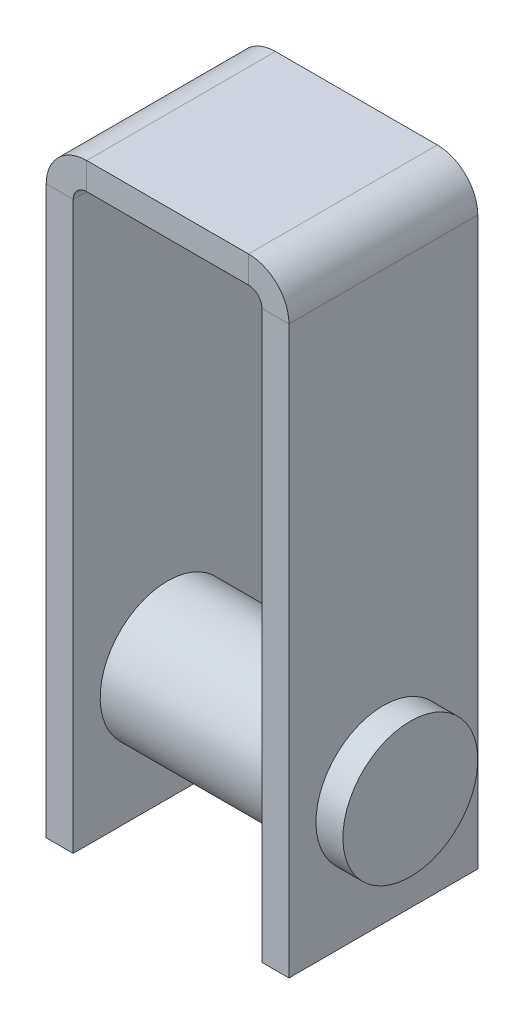
ISO-10303-21;
HEADER;
FILE_DESCRIPTION(('STEP AP214'),'2;1');
FILE_NAME('part.step','',(''),(''),'','','');
FILE_SCHEMA(('AUTOMOTIVE_DESIGN { 1 0 10303 214 1 1 1 1 }'));
ENDSEC;
DATA;
#1=APPLICATION_CONTEXT('core data for automotive mechanical design processes');
#2=APPLICATION_PROTOCOL_DEFINITION('international standard','automotive_design',2000,#1);
#3=PRODUCT_CONTEXT('',#1,'mechanical');
#4=PRODUCT('Part','Part','',(#3));
#5=PRODUCT_RELATED_PRODUCT_CATEGORY('part','',(#4));
#6=PRODUCT_DEFINITION_FORMATION('','',#4);
#7=PRODUCT_DEFINITION_CONTEXT('part definition',#1,'design');
#8=PRODUCT_DEFINITION('design','',#6,#7);
#9=PRODUCT_DEFINITION_SHAPE('','',#8);
#10=(LENGTH_UNIT() NAMED_UNIT(*) SI_UNIT(.MILLI.,.METRE.));
#11=(NAMED_UNIT(*) PLANE_ANGLE_UNIT() SI_UNIT($,.RADIAN.));
#12=(NAMED_UNIT(*) SI_UNIT($,.STERADIAN.) SOLID_ANGLE_UNIT());
#13=UNCERTAINTY_MEASURE_WITH_UNIT(LENGTH_MEASURE(1.E-05),#10,'distance_accuracy_value','');
#14=(GEOMETRIC_REPRESENTATION_CONTEXT(3) GLOBAL_UNCERTAINTY_ASSIGNED_CONTEXT((#13)) GLOBAL_UNIT_ASSIGNED_CONTEXT((#10,
#11,#12)) REPRESENTATION_CONTEXT('',''));
#15=CARTESIAN_POINT('',(0.,0.,0.));
#16=DIRECTION('',(0.,0.,1.));
#17=DIRECTION('',(1.,0.,0.));
#18=AXIS2_PLACEMENT_3D('',#15,#16,#17);
#19=CARTESIAN_POINT('',(-31.6451788984849,-220.,0.));
#20=DIRECTION('',(0.,-1.,0.));
#21=DIRECTION('',(0.,0.,1.));
#22=AXIS2_PLACEMENT_3D('',#19,#20,#21);
#23=PLANE('',#22);
#24=DIRECTION('',(-1.,0.,0.));
#25=VECTOR('',#24,1.);
#26=CARTESIAN_POINT('',(-26.6451788984849,-220.,-35.));
#27=LINE('',#26,#25);
#28=CARTESIAN_POINT('',(-26.6451788984849,-220.,-35.));
#29=VERTEX_POINT('',#28);
#30=CARTESIAN_POINT('',(-36.6451788984849,-220.,-35.));
#31=VERTEX_POINT('',#30);
#32=EDGE_CURVE('E143',#29,#31,#27,.T.);
#33=ORIENTED_EDGE('',*,*,#32,.F.);
#34=DIRECTION('',(0.,0.,-1.));
#35=VECTOR('',#34,1.);
#36=CARTESIAN_POINT('',(-26.6451788984849,-220.,35.));
#37=LINE('',#36,#35);
#38=CARTESIAN_POINT('',(-26.6451788984849,-220.,35.));
#39=VERTEX_POINT('',#38);
#40=EDGE_CURVE('E145',#39,#29,#37,.T.);
#41=ORIENTED_EDGE('',*,*,#40,.F.);
#42=DIRECTION('',(1.,0.,0.));
#43=VECTOR('',#42,1.);
#44=CARTESIAN_POINT('',(-26.6451788984849,-220.,35.));
#45=LINE('',#44,#43);
#46=CARTESIAN_POINT('',(-36.6451788984849,-220.,35.));
#47=VERTEX_POINT('',#46);
#48=EDGE_CURVE('E163',#47,#39,#45,.T.);
#49=ORIENTED_EDGE('',*,*,#48,.F.);
#50=DIRECTION('',(0.,0.,1.));
#51=VECTOR('',#50,1.);
#52=CARTESIAN_POINT('',(-36.6451788984849,-220.,35.));
#53=LINE('',#52,#51);
#54=EDGE_CURVE('E148',#31,#47,#53,.T.);
#55=ORIENTED_EDGE('',*,*,#54,.F.);
#56=EDGE_LOOP('',(#33,#41,#49,#55));
#57=FACE_BOUND('',#56,.T.);
#58=ADVANCED_FACE('F34',(#57),#23,.T.);
#59=CARTESIAN_POINT('',(48.3548211015151,-220.,0.));
#60=DIRECTION('',(0.,1.,0.));
#61=DIRECTION('',(0.,0.,1.));
#62=AXIS2_PLACEMENT_3D('',#59,#60,#61);
#63=PLANE('',#62);
#64=DIRECTION('',(1.,0.,0.));
#65=VECTOR('',#64,1.);
#66=CARTESIAN_POINT('',(43.3548211015151,-220.,-35.));
#67=LINE('',#66,#65);
#68=CARTESIAN_POINT('',(43.3548211015151,-220.,-35.));
#69=VERTEX_POINT('',#68);
#70=CARTESIAN_POINT('',(53.3548211015151,-220.,-35.));
#71=VERTEX_POINT('',#70);
#72=EDGE_CURVE('E204',#69,#71,#67,.T.);
#73=ORIENTED_EDGE('',*,*,#72,.T.);
#74=DIRECTION('',(0.,0.,1.));
#75=VECTOR('',#74,1.);
#76=CARTESIAN_POINT('',(53.3548211015151,-220.,35.));
#77=LINE('',#76,#75);
#78=CARTESIAN_POINT('',(53.3548211015151,-220.,35.));
#79=VERTEX_POINT('',#78);
#80=EDGE_CURVE('E54',#71,#79,#77,.T.);
#81=ORIENTED_EDGE('',*,*,#80,.T.);
#82=DIRECTION('',(-1.,0.,0.));
#83=VECTOR('',#82,1.);
#84=CARTESIAN_POINT('',(43.3548211015151,-220.,35.));
#85=LINE('',#84,#83);
#86=CARTESIAN_POINT('',(43.3548211015151,-220.,35.));
#87=VERTEX_POINT('',#86);
#88=EDGE_CURVE('E48',#79,#87,#85,.T.);
#89=ORIENTED_EDGE('',*,*,#88,.T.);
#90=DIRECTION('',(0.,0.,-1.));
#91=VECTOR('',#90,1.);
#92=CARTESIAN_POINT('',(43.3548211015151,-220.,35.));
#93=LINE('',#92,#91);
#94=EDGE_CURVE('E11',#87,#69,#93,.T.);
#95=ORIENTED_EDGE('',*,*,#94,.T.);
#96=EDGE_LOOP('',(#73,#81,#89,#95));
#97=FACE_BOUND('',#96,.T.);
#98=ADVANCED_FACE('F295',(#97),#63,.F.);
#99=CARTESIAN_POINT('',(-26.6451788984849,-220.,-35.));
#100=DIRECTION('',(0.,0.,-1.));
#101=DIRECTION('',(-1.,0.,0.));
#102=AXIS2_PLACEMENT_3D('',#99,#100,#101);
#103=PLANE('',#102);
#104=DIRECTION('',(0.,1.,0.));
#105=VECTOR('',#104,1.);
#106=CARTESIAN_POINT('',(-36.6451788984849,-220.,-35.));
#107=LINE('',#106,#105);
#108=CARTESIAN_POINT('',(-36.6451788984849,-10.0000000000001,-35.));
#109=VERTEX_POINT('',#108);
#110=EDGE_CURVE('E170',#31,#109,#107,.T.);
#111=ORIENTED_EDGE('',*,*,#110,.T.);
#112=DIRECTION('',(-1.,0.,0.));
#113=VECTOR('',#112,1.);
#114=CARTESIAN_POINT('',(-26.6451788984849,-10.0000000000001,-35.));
#115=LINE('',#114,#113);
#116=CARTESIAN_POINT('',(-26.6451788984849,-10.0000000000001,-35.));
#117=VERTEX_POINT('',#116);
#118=EDGE_CURVE('E168',#117,#109,#115,.T.);
#119=ORIENTED_EDGE('',*,*,#118,.F.);
#120=DIRECTION('',(0.,1.,0.));
#121=VECTOR('',#120,1.);
#122=CARTESIAN_POINT('',(-26.6451788984849,-220.,-35.));
#123=LINE('',#122,#121);
#124=EDGE_CURVE('E160',#29,#117,#123,.T.);
#125=ORIENTED_EDGE('',*,*,#124,.F.);
#126=ORIENTED_EDGE('',*,*,#32,.T.);
#127=EDGE_LOOP('',(#111,#119,#125,#126));
#128=FACE_BOUND('',#127,.T.);
#129=ADVANCED_FACE('F166',(#128),#103,.T.);
#130=CARTESIAN_POINT('',(-36.6451788984849,-220.,35.));
#131=DIRECTION('',(-1.,0.,0.));
#132=DIRECTION('',(0.,-1.,0.));
#133=AXIS2_PLACEMENT_3D('',#130,#131,#132);
#134=PLANE('',#133);
#135=CARTESIAN_POINT('',(-36.6451788984849,-175.,0.));
#136=DIRECTION('',(-1.,0.,0.));
#137=DIRECTION('',(0.,-1.,0.));
#138=AXIS2_PLACEMENT_3D('',#135,#136,#137);
#139=CIRCLE('',#138,25.);
#140=CARTESIAN_POINT('',(-36.6451788984849,-200.,0.));
#141=VERTEX_POINT('',#140);
#142=EDGE_CURVE('E534',#141,#141,#139,.T.);
#143=ORIENTED_EDGE('',*,*,#142,.F.);
#144=EDGE_LOOP('',(#143));
#145=FACE_BOUND('',#144,.T.);
#146=DIRECTION('',(0.,1.,0.));
#147=VECTOR('',#146,1.);
#148=CARTESIAN_POINT('',(-36.6451788984849,-220.,35.));
#149=LINE('',#148,#147);
#150=CARTESIAN_POINT('',(-36.6451788984849,-10.0000000000001,35.));
#151=VERTEX_POINT('',#150);
#152=EDGE_CURVE('E215',#47,#151,#149,.T.);
#153=ORIENTED_EDGE('',*,*,#152,.T.);
#154=DIRECTION('',(0.,0.,1.));
#155=VECTOR('',#154,1.);
#156=CARTESIAN_POINT('',(-36.6451788984849,-10.0000000000001,35.));
#157=LINE('',#156,#155);
#158=EDGE_CURVE('E212',#109,#151,#157,.T.);
#159=ORIENTED_EDGE('',*,*,#158,.F.);
#160=ORIENTED_EDGE('',*,*,#110,.F.);
#161=ORIENTED_EDGE('',*,*,#54,.T.);
#162=EDGE_LOOP('',(#153,#159,#160,#161));
#163=FACE_BOUND('',#162,.T.);
#164=ADVANCED_FACE('F333',(#145,#163),#134,.T.);
#165=CARTESIAN_POINT('',(-26.6451788984849,-220.,35.));
#166=DIRECTION('',(0.,0.,1.));
#167=DIRECTION('',(1.,0.,0.));
#168=AXIS2_PLACEMENT_3D('',#165,#166,#167);
#169=PLANE('',#168);
#170=DIRECTION('',(0.,1.,0.));
#171=VECTOR('',#170,1.);
#172=CARTESIAN_POINT('',(-26.6451788984849,-220.,35.));
#173=LINE('',#172,#171);
#174=CARTESIAN_POINT('',(-26.6451788984849,-10.0000000000001,35.));
#175=VERTEX_POINT('',#174);
#176=EDGE_CURVE('E162',#39,#175,#173,.T.);
#177=ORIENTED_EDGE('',*,*,#176,.T.);
#178=DIRECTION('',(1.,0.,0.));
#179=VECTOR('',#178,1.);
#180=CARTESIAN_POINT('',(-26.6451788984849,-10.0000000000001,35.));
#181=LINE('',#180,#179);
#182=EDGE_CURVE('E218',#151,#175,#181,.T.);
#183=ORIENTED_EDGE('',*,*,#182,.F.);
#184=ORIENTED_EDGE('',*,*,#152,.F.);
#185=ORIENTED_EDGE('',*,*,#48,.T.);
#186=EDGE_LOOP('',(#177,#183,#184,#185));
#187=FACE_BOUND('',#186,.T.);
#188=ADVANCED_FACE('F280',(#187),#169,.T.);
#189=CARTESIAN_POINT('',(-26.6451788984849,-220.,35.));
#190=DIRECTION('',(1.,0.,0.));
#191=DIRECTION('',(0.,1.,0.));
#192=AXIS2_PLACEMENT_3D('',#189,#190,#191);
#193=PLANE('',#192);
#194=CARTESIAN_POINT('',(-26.6451788984849,-175.,0.));
#195=DIRECTION('',(1.,0.,0.));
#196=DIRECTION('',(0.,1.,0.));
#197=AXIS2_PLACEMENT_3D('',#194,#195,#196);
#198=CIRCLE('',#197,25.);
#199=CARTESIAN_POINT('',(-26.6451788984849,-150.,0.));
#200=VERTEX_POINT('',#199);
#201=EDGE_CURVE('E153',#200,#200,#198,.T.);
#202=ORIENTED_EDGE('',*,*,#201,.F.);
#203=EDGE_LOOP('',(#202));
#204=FACE_BOUND('',#203,.T.);
#205=DIRECTION('',(0.,0.,-1.));
#206=VECTOR('',#205,1.);
#207=CARTESIAN_POINT('',(-26.6451788984849,-10.0000000000001,35.));
#208=LINE('',#207,#206);
#209=EDGE_CURVE('E183',#175,#117,#208,.T.);
#210=ORIENTED_EDGE('',*,*,#209,.F.);
#211=ORIENTED_EDGE('',*,*,#176,.F.);
#212=ORIENTED_EDGE('',*,*,#40,.T.);
#213=ORIENTED_EDGE('',*,*,#124,.T.);
#214=EDGE_LOOP('',(#210,#211,#212,#213));
#215=FACE_BOUND('',#214,.T.);
#216=ADVANCED_FACE('F159',(#204,#215),#193,.T.);
#217=CARTESIAN_POINT('',(-26.6451788984849,-10.,-35.));
#218=DIRECTION('',(0.,0.,-1.));
#219=DIRECTION('',(-1.,0.,0.));
#220=AXIS2_PLACEMENT_3D('',#217,#218,#219);
#221=PLANE('',#220);
#222=CARTESIAN_POINT('',(-21.6451788984849,-10.,-35.));
#223=DIRECTION('',(0.,0.,-1.));
#224=DIRECTION('',(-1.,0.,0.));
#225=AXIS2_PLACEMENT_3D('',#222,#223,#224);
#226=CIRCLE('',#225,15.);
#227=CARTESIAN_POINT('',(-21.6451788984848,5.00000000000001,-35.));
#228=VERTEX_POINT('',#227);
#229=EDGE_CURVE('E176',#109,#228,#226,.T.);
#230=ORIENTED_EDGE('',*,*,#229,.T.);
#231=DIRECTION('',(0.,1.,0.));
#232=VECTOR('',#231,1.);
#233=CARTESIAN_POINT('',(-21.6451788984848,-5.,-35.));
#234=LINE('',#233,#232);
#235=CARTESIAN_POINT('',(-21.6451788984848,-4.99999999999999,-35.));
#236=VERTEX_POINT('',#235);
#237=EDGE_CURVE('E174',#236,#228,#234,.T.);
#238=ORIENTED_EDGE('',*,*,#237,.F.);
#239=CARTESIAN_POINT('',(-21.6451788984849,-10.,-35.));
#240=DIRECTION('',(0.,0.,-1.));
#241=DIRECTION('',(-1.,0.,0.));
#242=AXIS2_PLACEMENT_3D('',#239,#240,#241);
#243=CIRCLE('',#242,5.);
#244=EDGE_CURVE('E177',#117,#236,#243,.T.);
#245=ORIENTED_EDGE('',*,*,#244,.F.);
#246=ORIENTED_EDGE('',*,*,#118,.T.);
#247=EDGE_LOOP('',(#230,#238,#245,#246));
#248=FACE_BOUND('',#247,.T.);
#249=ADVANCED_FACE('F276',(#248),#221,.T.);
#250=CARTESIAN_POINT('',(-21.6451788984849,-10.,0.));
#251=DIRECTION('',(0.,0.,-1.));
#252=DIRECTION('',(-1.,0.,0.));
#253=AXIS2_PLACEMENT_3D('',#250,#251,#252);
#254=CYLINDRICAL_SURFACE('',#253,15.);
#255=CARTESIAN_POINT('',(-21.6451788984849,-10.,35.));
#256=DIRECTION('',(0.,0.,-1.));
#257=DIRECTION('',(-1.,0.,0.));
#258=AXIS2_PLACEMENT_3D('',#255,#256,#257);
#259=CIRCLE('',#258,15.);
#260=CARTESIAN_POINT('',(-21.6451788984848,5.00000000000001,35.));
#261=VERTEX_POINT('',#260);
#262=EDGE_CURVE('E220',#151,#261,#259,.T.);
#263=ORIENTED_EDGE('',*,*,#262,.T.);
#264=DIRECTION('',(0.,0.,1.));
#265=VECTOR('',#264,1.);
#266=CARTESIAN_POINT('',(-21.6451788984848,5.,35.));
#267=LINE('',#266,#265);
#268=EDGE_CURVE('E180',#228,#261,#267,.T.);
#269=ORIENTED_EDGE('',*,*,#268,.F.);
#270=ORIENTED_EDGE('',*,*,#229,.F.);
#271=ORIENTED_EDGE('',*,*,#158,.T.);
#272=EDGE_LOOP('',(#263,#269,#270,#271));
#273=FACE_BOUND('',#272,.T.);
#274=ADVANCED_FACE('F287',(#273),#254,.T.);
#275=CARTESIAN_POINT('',(-26.6451788984849,-10.,35.));
#276=DIRECTION('',(0.,0.,1.));
#277=DIRECTION('',(1.,0.,0.));
#278=AXIS2_PLACEMENT_3D('',#275,#276,#277);
#279=PLANE('',#278);
#280=CARTESIAN_POINT('',(-21.6451788984849,-10.,35.));
#281=DIRECTION('',(0.,0.,-1.));
#282=DIRECTION('',(-1.,0.,0.));
#283=AXIS2_PLACEMENT_3D('',#280,#281,#282);
#284=CIRCLE('',#283,5.);
#285=CARTESIAN_POINT('',(-21.6451788984848,-4.99999999999999,35.));
#286=VERTEX_POINT('',#285);
#287=EDGE_CURVE('E241',#175,#286,#284,.T.);
#288=ORIENTED_EDGE('',*,*,#287,.T.);
#289=DIRECTION('',(0.,-1.,0.));
#290=VECTOR('',#289,1.);
#291=CARTESIAN_POINT('',(-21.6451788984848,-5.,35.));
#292=LINE('',#291,#290);
#293=EDGE_CURVE('E223',#261,#286,#292,.T.);
#294=ORIENTED_EDGE('',*,*,#293,.F.);
#295=ORIENTED_EDGE('',*,*,#262,.F.);
#296=ORIENTED_EDGE('',*,*,#182,.T.);
#297=EDGE_LOOP('',(#288,#294,#295,#296));
#298=FACE_BOUND('',#297,.T.);
#299=ADVANCED_FACE('F283',(#298),#279,.T.);
#300=CARTESIAN_POINT('',(-21.6451788984849,-10.,0.));
#301=DIRECTION('',(0.,0.,-1.));
#302=DIRECTION('',(-1.,0.,0.));
#303=AXIS2_PLACEMENT_3D('',#300,#301,#302);
#304=CYLINDRICAL_SURFACE('',#303,5.);
#305=DIRECTION('',(0.,0.,-1.));
#306=VECTOR('',#305,1.);
#307=CARTESIAN_POINT('',(-21.6451788984848,-5.,35.));
#308=LINE('',#307,#306);
#309=EDGE_CURVE('E192',#286,#236,#308,.T.);
#310=ORIENTED_EDGE('',*,*,#309,.F.);
#311=ORIENTED_EDGE('',*,*,#287,.F.);
#312=ORIENTED_EDGE('',*,*,#209,.T.);
#313=ORIENTED_EDGE('',*,*,#244,.T.);
#314=EDGE_LOOP('',(#310,#311,#312,#313));
#315=FACE_BOUND('',#314,.T.);
#316=ADVANCED_FACE('F277',(#315),#304,.F.);
#317=CARTESIAN_POINT('',(-21.6451788984848,-5.,-35.));
#318=DIRECTION('',(0.,0.,-1.));
#319=DIRECTION('',(-1.,0.,0.));
#320=AXIS2_PLACEMENT_3D('',#317,#318,#319);
#321=PLANE('',#320);
#322=DIRECTION('',(1.,0.,0.));
#323=VECTOR('',#322,1.);
#324=CARTESIAN_POINT('',(-21.6451788984848,5.,-35.));
#325=LINE('',#324,#323);
#326=CARTESIAN_POINT('',(38.354821101515,5.,-35.));
#327=VERTEX_POINT('',#326);
#328=EDGE_CURVE('E125',#228,#327,#325,.T.);
#329=ORIENTED_EDGE('',*,*,#328,.T.);
#330=DIRECTION('',(0.,1.,0.));
#331=VECTOR('',#330,1.);
#332=CARTESIAN_POINT('',(38.354821101515,-5.,-35.));
#333=LINE('',#332,#331);
#334=CARTESIAN_POINT('',(38.354821101515,-5.,-35.));
#335=VERTEX_POINT('',#334);
#336=EDGE_CURVE('E184',#335,#327,#333,.T.);
#337=ORIENTED_EDGE('',*,*,#336,.F.);
#338=DIRECTION('',(1.,0.,0.));
#339=VECTOR('',#338,1.);
#340=CARTESIAN_POINT('',(-21.6451788984848,-5.,-35.));
#341=LINE('',#340,#339);
#342=EDGE_CURVE('E190',#236,#335,#341,.T.);
#343=ORIENTED_EDGE('',*,*,#342,.F.);
#344=ORIENTED_EDGE('',*,*,#237,.T.);
#345=EDGE_LOOP('',(#329,#337,#343,#344));
#346=FACE_BOUND('',#345,.T.);
#347=ADVANCED_FACE('F270',(#346),#321,.T.);
#348=CARTESIAN_POINT('',(-21.6451788984848,5.,35.));
#349=DIRECTION('',(0.,1.,0.));
#350=DIRECTION('',(0.,0.,1.));
#351=AXIS2_PLACEMENT_3D('',#348,#349,#350);
#352=PLANE('',#351);
#353=DIRECTION('',(1.,0.,0.));
#354=VECTOR('',#353,1.);
#355=CARTESIAN_POINT('',(-21.6451788984848,5.,35.));
#356=LINE('',#355,#354);
#357=CARTESIAN_POINT('',(38.354821101515,5.,35.));
#358=VERTEX_POINT('',#357);
#359=EDGE_CURVE('E118',#261,#358,#356,.T.);
#360=ORIENTED_EDGE('',*,*,#359,.T.);
#361=DIRECTION('',(0.,0.,1.));
#362=VECTOR('',#361,1.);
#363=CARTESIAN_POINT('',(38.354821101515,5.,35.));
#364=LINE('',#363,#362);
#365=EDGE_CURVE('E187',#327,#358,#364,.T.);
#366=ORIENTED_EDGE('',*,*,#365,.F.);
#367=ORIENTED_EDGE('',*,*,#328,.F.);
#368=ORIENTED_EDGE('',*,*,#268,.T.);
#369=EDGE_LOOP('',(#360,#366,#367,#368));
#370=FACE_BOUND('',#369,.T.);
#371=ADVANCED_FACE('F289',(#370),#352,.T.);
#372=CARTESIAN_POINT('',(-21.6451788984848,-5.,35.));
#373=DIRECTION('',(0.,0.,1.));
#374=DIRECTION('',(1.,0.,0.));
#375=AXIS2_PLACEMENT_3D('',#372,#373,#374);
#376=PLANE('',#375);
#377=DIRECTION('',(1.,0.,0.));
#378=VECTOR('',#377,1.);
#379=CARTESIAN_POINT('',(-21.6451788984848,-5.,35.));
#380=LINE('',#379,#378);
#381=CARTESIAN_POINT('',(38.354821101515,-5.,35.));
#382=VERTEX_POINT('',#381);
#383=EDGE_CURVE('E188',#286,#382,#380,.T.);
#384=ORIENTED_EDGE('',*,*,#383,.T.);
#385=DIRECTION('',(0.,-1.,0.));
#386=VECTOR('',#385,1.);
#387=CARTESIAN_POINT('',(38.354821101515,-5.,35.));
#388=LINE('',#387,#386);
#389=EDGE_CURVE('E226',#358,#382,#388,.T.);
#390=ORIENTED_EDGE('',*,*,#389,.F.);
#391=ORIENTED_EDGE('',*,*,#359,.F.);
#392=ORIENTED_EDGE('',*,*,#293,.T.);
#393=EDGE_LOOP('',(#384,#390,#391,#392));
#394=FACE_BOUND('',#393,.T.);
#395=ADVANCED_FACE('F301',(#394),#376,.T.);
#396=CARTESIAN_POINT('',(-21.6451788984848,-5.,35.));
#397=DIRECTION('',(0.,-1.,0.));
#398=DIRECTION('',(0.,0.,-1.));
#399=AXIS2_PLACEMENT_3D('',#396,#397,#398);
#400=PLANE('',#399);
#401=DIRECTION('',(0.,0.,-1.));
#402=VECTOR('',#401,1.);
#403=CARTESIAN_POINT('',(38.354821101515,-5.,35.));
#404=LINE('',#403,#402);
#405=EDGE_CURVE('E203',#382,#335,#404,.T.);
#406=ORIENTED_EDGE('',*,*,#405,.F.);
#407=ORIENTED_EDGE('',*,*,#383,.F.);
#408=ORIENTED_EDGE('',*,*,#309,.T.);
#409=ORIENTED_EDGE('',*,*,#342,.T.);
#410=EDGE_LOOP('',(#406,#407,#408,#409));
#411=FACE_BOUND('',#410,.T.);
#412=ADVANCED_FACE('F273',(#411),#400,.T.);
#413=CARTESIAN_POINT('',(38.354821101515,-5.,-35.));
#414=DIRECTION('',(0.,0.,-1.));
#415=DIRECTION('',(-1.,0.,0.));
#416=AXIS2_PLACEMENT_3D('',#413,#414,#415);
#417=PLANE('',#416);
#418=CARTESIAN_POINT('',(38.3548211015151,-10.,-35.));
#419=DIRECTION('',(0.,0.,-1.));
#420=DIRECTION('',(0.,1.,0.));
#421=AXIS2_PLACEMENT_3D('',#418,#419,#420);
#422=CIRCLE('',#421,15.);
#423=CARTESIAN_POINT('',(53.3548211015151,-10.,-35.));
#424=VERTEX_POINT('',#423);
#425=EDGE_CURVE('E196',#327,#424,#422,.T.);
#426=ORIENTED_EDGE('',*,*,#425,.T.);
#427=DIRECTION('',(1.,0.,0.));
#428=VECTOR('',#427,1.);
#429=CARTESIAN_POINT('',(43.3548211015151,-10.,-35.));
#430=LINE('',#429,#428);
#431=CARTESIAN_POINT('',(43.3548211015151,-10.,-35.));
#432=VERTEX_POINT('',#431);
#433=EDGE_CURVE('E193',#432,#424,#430,.T.);
#434=ORIENTED_EDGE('',*,*,#433,.F.);
#435=CARTESIAN_POINT('',(38.3548211015151,-10.,-35.));
#436=DIRECTION('',(0.,0.,-1.));
#437=DIRECTION('',(0.,1.,0.));
#438=AXIS2_PLACEMENT_3D('',#435,#436,#437);
#439=CIRCLE('',#438,5.);
#440=EDGE_CURVE('E197',#335,#432,#439,.T.);
#441=ORIENTED_EDGE('',*,*,#440,.F.);
#442=ORIENTED_EDGE('',*,*,#336,.T.);
#443=EDGE_LOOP('',(#426,#434,#441,#442));
#444=FACE_BOUND('',#443,.T.);
#445=ADVANCED_FACE('F265',(#444),#417,.T.);
#446=CARTESIAN_POINT('',(38.3548211015151,-10.,0.));
#447=DIRECTION('',(0.,0.,-1.));
#448=DIRECTION('',(-1.,0.,0.));
#449=AXIS2_PLACEMENT_3D('',#446,#447,#448);
#450=CYLINDRICAL_SURFACE('',#449,15.);
#451=CARTESIAN_POINT('',(38.3548211015151,-10.,35.));
#452=DIRECTION('',(0.,0.,-1.));
#453=DIRECTION('',(0.,1.,0.));
#454=AXIS2_PLACEMENT_3D('',#451,#452,#453);
#455=CIRCLE('',#454,15.);
#456=CARTESIAN_POINT('',(53.3548211015151,-10.,35.));
#457=VERTEX_POINT('',#456);
#458=EDGE_CURVE('E229',#358,#457,#455,.T.);
#459=ORIENTED_EDGE('',*,*,#458,.T.);
#460=DIRECTION('',(0.,0.,1.));
#461=VECTOR('',#460,1.);
#462=CARTESIAN_POINT('',(53.3548211015151,-10.,35.));
#463=LINE('',#462,#461);
#464=EDGE_CURVE('E200',#424,#457,#463,.T.);
#465=ORIENTED_EDGE('',*,*,#464,.F.);
#466=ORIENTED_EDGE('',*,*,#425,.F.);
#467=ORIENTED_EDGE('',*,*,#365,.T.);
#468=EDGE_LOOP('',(#459,#465,#466,#467));
#469=FACE_BOUND('',#468,.T.);
#470=ADVANCED_FACE('F291',(#469),#450,.T.);
#471=CARTESIAN_POINT('',(38.354821101515,-5.,35.));
#472=DIRECTION('',(0.,0.,1.));
#473=DIRECTION('',(1.,0.,0.));
#474=AXIS2_PLACEMENT_3D('',#471,#472,#473);
#475=PLANE('',#474);
#476=CARTESIAN_POINT('',(38.3548211015151,-10.,35.));
#477=DIRECTION('',(0.,0.,-1.));
#478=DIRECTION('',(0.,1.,0.));
#479=AXIS2_PLACEMENT_3D('',#476,#477,#478);
#480=CIRCLE('',#479,5.);
#481=CARTESIAN_POINT('',(43.3548211015151,-10.,35.));
#482=VERTEX_POINT('',#481);
#483=EDGE_CURVE('E248',#382,#482,#480,.T.);
#484=ORIENTED_EDGE('',*,*,#483,.T.);
#485=DIRECTION('',(-1.,0.,0.));
#486=VECTOR('',#485,1.);
#487=CARTESIAN_POINT('',(43.3548211015151,-10.,35.));
#488=LINE('',#487,#486);
#489=EDGE_CURVE('E232',#457,#482,#488,.T.);
#490=ORIENTED_EDGE('',*,*,#489,.F.);
#491=ORIENTED_EDGE('',*,*,#458,.F.);
#492=ORIENTED_EDGE('',*,*,#389,.T.);
#493=EDGE_LOOP('',(#484,#490,#491,#492));
#494=FACE_BOUND('',#493,.T.);
#495=ADVANCED_FACE('F298',(#494),#475,.T.);
#496=CARTESIAN_POINT('',(38.3548211015151,-10.,0.));
#497=DIRECTION('',(0.,0.,-1.));
#498=DIRECTION('',(-1.,0.,0.));
#499=AXIS2_PLACEMENT_3D('',#496,#497,#498);
#500=CYLINDRICAL_SURFACE('',#499,5.);
#501=DIRECTION('',(0.,0.,-1.));
#502=VECTOR('',#501,1.);
#503=CARTESIAN_POINT('',(43.3548211015151,-10.,35.));
#504=LINE('',#503,#502);
#505=EDGE_CURVE('E210',#482,#432,#504,.T.);
#506=ORIENTED_EDGE('',*,*,#505,.F.);
#507=ORIENTED_EDGE('',*,*,#483,.F.);
#508=ORIENTED_EDGE('',*,*,#405,.T.);
#509=ORIENTED_EDGE('',*,*,#440,.T.);
#510=EDGE_LOOP('',(#506,#507,#508,#509));
#511=FACE_BOUND('',#510,.T.);
#512=ADVANCED_FACE('F267',(#511),#500,.F.);
#513=CARTESIAN_POINT('',(43.3548211015151,-10.0000000000001,-35.));
#514=DIRECTION('',(0.,0.,-1.));
#515=DIRECTION('',(-1.,0.,0.));
#516=AXIS2_PLACEMENT_3D('',#513,#514,#515);
#517=PLANE('',#516);
#518=DIRECTION('',(0.,-1.,0.));
#519=VECTOR('',#518,1.);
#520=CARTESIAN_POINT('',(53.3548211015151,-10.0000000000001,-35.));
#521=LINE('',#520,#519);
#522=EDGE_CURVE('E99',#424,#71,#521,.T.);
#523=ORIENTED_EDGE('',*,*,#522,.T.);
#524=ORIENTED_EDGE('',*,*,#72,.F.);
#525=DIRECTION('',(0.,-1.,0.));
#526=VECTOR('',#525,1.);
#527=CARTESIAN_POINT('',(43.3548211015151,-10.0000000000001,-35.));
#528=LINE('',#527,#526);
#529=EDGE_CURVE('E206',#432,#69,#528,.T.);
#530=ORIENTED_EDGE('',*,*,#529,.F.);
#531=ORIENTED_EDGE('',*,*,#433,.T.);
#532=EDGE_LOOP('',(#523,#524,#530,#531));
#533=FACE_BOUND('',#532,.T.);
#534=ADVANCED_FACE('F294',(#533),#517,.T.);
#535=CARTESIAN_POINT('',(53.3548211015151,-10.0000000000001,35.));
#536=DIRECTION('',(1.,0.,0.));
#537=DIRECTION('',(0.,1.,0.));
#538=AXIS2_PLACEMENT_3D('',#535,#536,#537);
#539=PLANE('',#538);
#540=CARTESIAN_POINT('',(53.3548211015151,-175.,0.));
#541=DIRECTION('',(1.,0.,0.));
#542=DIRECTION('',(0.,1.,0.));
#543=AXIS2_PLACEMENT_3D('',#540,#541,#542);
#544=CIRCLE('',#543,25.);
#545=CARTESIAN_POINT('',(53.3548211015151,-150.,0.));
#546=VERTEX_POINT('',#545);
#547=EDGE_CURVE('E538',#546,#546,#544,.T.);
#548=ORIENTED_EDGE('',*,*,#547,.F.);
#549=EDGE_LOOP('',(#548));
#550=FACE_BOUND('',#549,.T.);
#551=DIRECTION('',(0.,-1.,0.));
#552=VECTOR('',#551,1.);
#553=CARTESIAN_POINT('',(53.3548211015151,-10.0000000000001,35.));
#554=LINE('',#553,#552);
#555=EDGE_CURVE('E92',#457,#79,#554,.T.);
#556=ORIENTED_EDGE('',*,*,#555,.T.);
#557=ORIENTED_EDGE('',*,*,#80,.F.);
#558=ORIENTED_EDGE('',*,*,#522,.F.);
#559=ORIENTED_EDGE('',*,*,#464,.T.);
#560=EDGE_LOOP('',(#556,#557,#558,#559));
#561=FACE_BOUND('',#560,.T.);
#562=ADVANCED_FACE('F292',(#550,#561),#539,.T.);
#563=CARTESIAN_POINT('',(43.3548211015151,-10.0000000000001,35.));
#564=DIRECTION('',(0.,0.,1.));
#565=DIRECTION('',(1.,0.,0.));
#566=AXIS2_PLACEMENT_3D('',#563,#564,#565);
#567=PLANE('',#566);
#568=DIRECTION('',(0.,-1.,0.));
#569=VECTOR('',#568,1.);
#570=CARTESIAN_POINT('',(43.3548211015151,-10.0000000000001,35.));
#571=LINE('',#570,#569);
#572=EDGE_CURVE('E42',#482,#87,#571,.T.);
#573=ORIENTED_EDGE('',*,*,#572,.T.);
#574=ORIENTED_EDGE('',*,*,#88,.F.);
#575=ORIENTED_EDGE('',*,*,#555,.F.);
#576=ORIENTED_EDGE('',*,*,#489,.T.);
#577=EDGE_LOOP('',(#573,#574,#575,#576));
#578=FACE_BOUND('',#577,.T.);
#579=ADVANCED_FACE('F296',(#578),#567,.T.);
#580=CARTESIAN_POINT('',(43.3548211015151,-10.0000000000001,35.));
#581=DIRECTION('',(-1.,0.,0.));
#582=DIRECTION('',(0.,-1.,0.));
#583=AXIS2_PLACEMENT_3D('',#580,#581,#582);
#584=PLANE('',#583);
#585=CARTESIAN_POINT('',(43.3548211015151,-175.,0.));
#586=DIRECTION('',(-1.,0.,0.));
#587=DIRECTION('',(0.,-1.,0.));
#588=AXIS2_PLACEMENT_3D('',#585,#586,#587);
#589=CIRCLE('',#588,25.);
#590=CARTESIAN_POINT('',(43.3548211015151,-200.,0.));
#591=VERTEX_POINT('',#590);
#592=EDGE_CURVE('E37',#591,#591,#589,.T.);
#593=ORIENTED_EDGE('',*,*,#592,.F.);
#594=EDGE_LOOP('',(#593));
#595=FACE_BOUND('',#594,.T.);
#596=ORIENTED_EDGE('',*,*,#94,.F.);
#597=ORIENTED_EDGE('',*,*,#572,.F.);
#598=ORIENTED_EDGE('',*,*,#505,.T.);
#599=ORIENTED_EDGE('',*,*,#529,.T.);
#600=EDGE_LOOP('',(#596,#597,#598,#599));
#601=FACE_BOUND('',#600,.T.);
#602=ADVANCED_FACE('F260',(#595,#601),#584,.T.);
#603=CARTESIAN_POINT('',(-46.6451788984849,-175.,0.));
#604=DIRECTION('',(1.,0.,0.));
#605=DIRECTION('',(0.,1.,0.));
#606=AXIS2_PLACEMENT_3D('',#603,#604,#605);
#607=CYLINDRICAL_SURFACE('',#606,25.);
#608=ORIENTED_EDGE('',*,*,#201,.T.);
#609=EDGE_LOOP('',(#608));
#610=FACE_BOUND('',#609,.T.);
#611=ORIENTED_EDGE('',*,*,#592,.T.);
#612=EDGE_LOOP('',(#611));
#613=FACE_BOUND('',#612,.T.);
#614=ADVANCED_FACE('F313',(#610,#613),#607,.T.);
#615=CARTESIAN_POINT('',(63.3548211015151,-175.,0.));
#616=DIRECTION('',(1.,0.,0.));
#617=DIRECTION('',(0.,1.,0.));
#618=AXIS2_PLACEMENT_3D('',#615,#616,#617);
#619=PLANE('',#618);
#620=CARTESIAN_POINT('',(63.3548211015151,-175.,0.));
#621=DIRECTION('',(1.,0.,0.));
#622=DIRECTION('',(0.,1.,0.));
#623=AXIS2_PLACEMENT_3D('',#620,#621,#622);
#624=CIRCLE('',#623,25.);
#625=CARTESIAN_POINT('',(63.3548211015151,-150.,0.));
#626=VERTEX_POINT('',#625);
#627=EDGE_CURVE('E535',#626,#626,#624,.T.);
#628=ORIENTED_EDGE('',*,*,#627,.T.);
#629=EDGE_LOOP('',(#628));
#630=FACE_BOUND('',#629,.T.);
#631=ADVANCED_FACE('F320',(#630),#619,.T.);
#632=ORIENTED_EDGE('',*,*,#547,.T.);
#633=EDGE_LOOP('',(#632));
#634=FACE_BOUND('',#633,.T.);
#635=ORIENTED_EDGE('',*,*,#627,.F.);
#636=EDGE_LOOP('',(#635));
#637=FACE_BOUND('',#636,.T.);
#638=ADVANCED_FACE('F324',(#634,#637),#607,.T.);
#639=ORIENTED_EDGE('',*,*,#142,.T.);
#640=EDGE_LOOP('',(#639));
#641=FACE_BOUND('',#640,.T.);
#642=CARTESIAN_POINT('',(-46.6451788984849,-175.,0.));
#643=DIRECTION('',(1.,0.,0.));
#644=DIRECTION('',(0.,1.,0.));
#645=AXIS2_PLACEMENT_3D('',#642,#643,#644);
#646=CIRCLE('',#645,25.);
#647=CARTESIAN_POINT('',(-46.6451788984849,-150.,0.));
#648=VERTEX_POINT('',#647);
#649=EDGE_CURVE('E532',#648,#648,#646,.T.);
#650=ORIENTED_EDGE('',*,*,#649,.T.);
#651=EDGE_LOOP('',(#650));
#652=FACE_BOUND('',#651,.T.);
#653=ADVANCED_FACE('F323',(#641,#652),#607,.T.);
#654=CARTESIAN_POINT('',(-46.6451788984849,-175.,0.));
#655=DIRECTION('',(1.,0.,0.));
#656=DIRECTION('',(0.,1.,0.));
#657=AXIS2_PLACEMENT_3D('',#654,#655,#656);
#658=PLANE('',#657);
#659=ORIENTED_EDGE('',*,*,#649,.F.);
#660=EDGE_LOOP('',(#659));
#661=FACE_BOUND('',#660,.T.);
#662=ADVANCED_FACE('F517',(#661),#658,.F.);
#663=CLOSED_SHELL('',(#58,#98,#129,#164,#188,#216,#249,#274,#299,#316,#347,#371,#395,#412,#445,
#470,#495,#512,#534,#562,#579,#602,#614,#631,#638,#653,#662));
#664=MANIFOLD_SOLID_BREP('B2',#663);
#665=ADVANCED_BREP_SHAPE_REPRESENTATION('',(#18,#664),#14);
#666=SHAPE_DEFINITION_REPRESENTATION(#9,#665);
ENDSEC;
END-ISO-10303-21;
